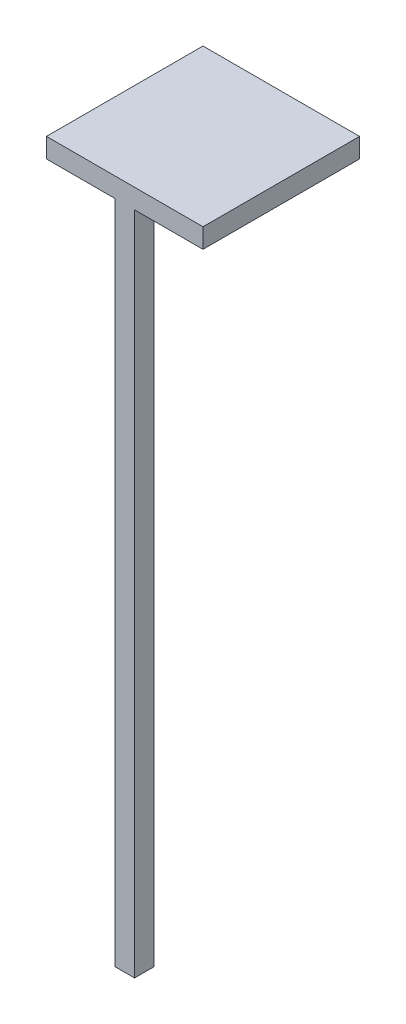
ISO-10303-21;
HEADER;
FILE_DESCRIPTION(('STEP AP214'),'2;1');
FILE_NAME('part.step','',(''),(''),'','','');
FILE_SCHEMA(('AUTOMOTIVE_DESIGN { 1 0 10303 214 1 1 1 1 }'));
ENDSEC;
DATA;
#1=APPLICATION_CONTEXT('core data for automotive mechanical design processes');
#2=APPLICATION_PROTOCOL_DEFINITION('international standard','automotive_design',2000,#1);
#3=PRODUCT_CONTEXT('',#1,'mechanical');
#4=PRODUCT('Part','Part','',(#3));
#5=PRODUCT_RELATED_PRODUCT_CATEGORY('part','',(#4));
#6=PRODUCT_DEFINITION_FORMATION('','',#4);
#7=PRODUCT_DEFINITION_CONTEXT('part definition',#1,'design');
#8=PRODUCT_DEFINITION('design','',#6,#7);
#9=PRODUCT_DEFINITION_SHAPE('','',#8);
#10=(LENGTH_UNIT() NAMED_UNIT(*) SI_UNIT(.MILLI.,.METRE.));
#11=(NAMED_UNIT(*) PLANE_ANGLE_UNIT() SI_UNIT($,.RADIAN.));
#12=(NAMED_UNIT(*) SI_UNIT($,.STERADIAN.) SOLID_ANGLE_UNIT());
#13=UNCERTAINTY_MEASURE_WITH_UNIT(LENGTH_MEASURE(1.E-05),#10,'distance_accuracy_value','');
#14=(GEOMETRIC_REPRESENTATION_CONTEXT(3) GLOBAL_UNCERTAINTY_ASSIGNED_CONTEXT((#13)) GLOBAL_UNIT_ASSIGNED_CONTEXT((#10,
#11,#12)) REPRESENTATION_CONTEXT('',''));
#15=CARTESIAN_POINT('',(0.,0.,0.));
#16=DIRECTION('',(0.,0.,1.));
#17=DIRECTION('',(1.,0.,0.));
#18=AXIS2_PLACEMENT_3D('',#15,#16,#17);
#19=CARTESIAN_POINT('',(0.,340.,0.));
#20=DIRECTION('',(1.,0.,0.));
#21=DIRECTION('',(0.,0.,-1.));
#22=AXIS2_PLACEMENT_3D('',#19,#20,#21);
#23=PLANE('',#22);
#24=DIRECTION('',(0.,0.,1.));
#25=VECTOR('',#24,1.);
#26=CARTESIAN_POINT('',(0.,0.,0.));
#27=LINE('',#26,#25);
#28=CARTESIAN_POINT('',(0.,0.,-10.));
#29=VERTEX_POINT('',#28);
#30=CARTESIAN_POINT('',(0.,0.,0.));
#31=VERTEX_POINT('',#30);
#32=EDGE_CURVE('E129',#29,#31,#27,.T.);
#33=ORIENTED_EDGE('',*,*,#32,.T.);
#34=DIRECTION('',(0.,-1.,0.));
#35=VECTOR('',#34,1.);
#36=CARTESIAN_POINT('',(0.,340.,0.));
#37=LINE('',#36,#35);
#38=CARTESIAN_POINT('',(0.,340.,0.));
#39=VERTEX_POINT('',#38);
#40=EDGE_CURVE('E11',#39,#31,#37,.T.);
#41=ORIENTED_EDGE('',*,*,#40,.F.);
#42=DIRECTION('',(0.,0.,1.));
#43=VECTOR('',#42,1.);
#44=CARTESIAN_POINT('',(0.,340.,0.));
#45=LINE('',#44,#43);
#46=CARTESIAN_POINT('',(0.,340.,-10.));
#47=VERTEX_POINT('',#46);
#48=EDGE_CURVE('E187',#47,#39,#45,.T.);
#49=ORIENTED_EDGE('',*,*,#48,.F.);
#50=DIRECTION('',(0.,-1.,0.));
#51=VECTOR('',#50,1.);
#52=CARTESIAN_POINT('',(0.,340.,-10.));
#53=LINE('',#52,#51);
#54=EDGE_CURVE('E180',#47,#29,#53,.T.);
#55=ORIENTED_EDGE('',*,*,#54,.T.);
#56=EDGE_LOOP('',(#33,#41,#49,#55));
#57=FACE_BOUND('',#56,.T.);
#58=ADVANCED_FACE('F30',(#57),#23,.F.);
#59=CARTESIAN_POINT('',(0.,340.,0.));
#60=DIRECTION('',(0.,0.,-1.));
#61=DIRECTION('',(-1.,0.,0.));
#62=AXIS2_PLACEMENT_3D('',#59,#60,#61);
#63=PLANE('',#62);
#64=DIRECTION('',(1.,0.,0.));
#65=VECTOR('',#64,1.);
#66=CARTESIAN_POINT('',(0.,0.,0.));
#67=LINE('',#66,#65);
#68=CARTESIAN_POINT('',(10.,0.,0.));
#69=VERTEX_POINT('',#68);
#70=EDGE_CURVE('E131',#31,#69,#67,.T.);
#71=ORIENTED_EDGE('',*,*,#70,.T.);
#72=DIRECTION('',(0.,-1.,0.));
#73=VECTOR('',#72,1.);
#74=CARTESIAN_POINT('',(10.,340.,0.));
#75=LINE('',#74,#73);
#76=CARTESIAN_POINT('',(10.,340.,0.));
#77=VERTEX_POINT('',#76);
#78=EDGE_CURVE('E39',#77,#69,#75,.T.);
#79=ORIENTED_EDGE('',*,*,#78,.F.);
#80=DIRECTION('',(1.,0.,0.));
#81=VECTOR('',#80,1.);
#82=CARTESIAN_POINT('',(-35.,340.,0.));
#83=LINE('',#82,#81);
#84=CARTESIAN_POINT('',(45.,340.,0.));
#85=VERTEX_POINT('',#84);
#86=EDGE_CURVE('E141',#77,#85,#83,.T.);
#87=ORIENTED_EDGE('',*,*,#86,.T.);
#88=DIRECTION('',(0.,-1.,0.));
#89=VECTOR('',#88,1.);
#90=CARTESIAN_POINT('',(45.,350.,0.));
#91=LINE('',#90,#89);
#92=CARTESIAN_POINT('',(45.,350.,0.));
#93=VERTEX_POINT('',#92);
#94=EDGE_CURVE('E111',#93,#85,#91,.T.);
#95=ORIENTED_EDGE('',*,*,#94,.F.);
#96=DIRECTION('',(1.,0.,0.));
#97=VECTOR('',#96,1.);
#98=CARTESIAN_POINT('',(-35.,350.,0.));
#99=LINE('',#98,#97);
#100=CARTESIAN_POINT('',(-35.,350.,0.));
#101=VERTEX_POINT('',#100);
#102=EDGE_CURVE('E103',#101,#93,#99,.T.);
#103=ORIENTED_EDGE('',*,*,#102,.F.);
#104=DIRECTION('',(0.,-1.,0.));
#105=VECTOR('',#104,1.);
#106=CARTESIAN_POINT('',(-35.,350.,0.));
#107=LINE('',#106,#105);
#108=CARTESIAN_POINT('',(-35.,340.,0.));
#109=VERTEX_POINT('',#108);
#110=EDGE_CURVE('E108',#101,#109,#107,.T.);
#111=ORIENTED_EDGE('',*,*,#110,.T.);
#112=EDGE_CURVE('E137',#109,#39,#83,.T.);
#113=ORIENTED_EDGE('',*,*,#112,.T.);
#114=ORIENTED_EDGE('',*,*,#40,.T.);
#115=EDGE_LOOP('',(#71,#79,#87,#95,#103,#111,#113,#114));
#116=FACE_BOUND('',#115,.T.);
#117=ADVANCED_FACE('F105',(#116),#63,.F.);
#118=CARTESIAN_POINT('',(10.,340.,0.));
#119=DIRECTION('',(-1.,0.,0.));
#120=DIRECTION('',(0.,0.,1.));
#121=AXIS2_PLACEMENT_3D('',#118,#119,#120);
#122=PLANE('',#121);
#123=DIRECTION('',(0.,0.,-1.));
#124=VECTOR('',#123,1.);
#125=CARTESIAN_POINT('',(10.,0.,0.));
#126=LINE('',#125,#124);
#127=CARTESIAN_POINT('',(10.,0.,-10.));
#128=VERTEX_POINT('',#127);
#129=EDGE_CURVE('E63',#69,#128,#126,.T.);
#130=ORIENTED_EDGE('',*,*,#129,.T.);
#131=DIRECTION('',(0.,-1.,0.));
#132=VECTOR('',#131,1.);
#133=CARTESIAN_POINT('',(10.,340.,-10.));
#134=LINE('',#133,#132);
#135=CARTESIAN_POINT('',(10.,340.,-10.));
#136=VERTEX_POINT('',#135);
#137=EDGE_CURVE('E47',#136,#128,#134,.T.);
#138=ORIENTED_EDGE('',*,*,#137,.F.);
#139=DIRECTION('',(0.,0.,-1.));
#140=VECTOR('',#139,1.);
#141=CARTESIAN_POINT('',(10.,340.,0.));
#142=LINE('',#141,#140);
#143=EDGE_CURVE('E194',#77,#136,#142,.T.);
#144=ORIENTED_EDGE('',*,*,#143,.F.);
#145=ORIENTED_EDGE('',*,*,#78,.T.);
#146=EDGE_LOOP('',(#130,#138,#144,#145));
#147=FACE_BOUND('',#146,.T.);
#148=ADVANCED_FACE('F178',(#147),#122,.F.);
#149=CARTESIAN_POINT('',(0.,340.,-10.));
#150=DIRECTION('',(0.,0.,1.));
#151=DIRECTION('',(1.,0.,0.));
#152=AXIS2_PLACEMENT_3D('',#149,#150,#151);
#153=PLANE('',#152);
#154=DIRECTION('',(-1.,0.,0.));
#155=VECTOR('',#154,1.);
#156=CARTESIAN_POINT('',(0.,0.,-10.));
#157=LINE('',#156,#155);
#158=EDGE_CURVE('E68',#128,#29,#157,.T.);
#159=ORIENTED_EDGE('',*,*,#158,.T.);
#160=ORIENTED_EDGE('',*,*,#54,.F.);
#161=DIRECTION('',(-1.,0.,0.));
#162=VECTOR('',#161,1.);
#163=CARTESIAN_POINT('',(0.,340.,-10.));
#164=LINE('',#163,#162);
#165=EDGE_CURVE('E189',#136,#47,#164,.T.);
#166=ORIENTED_EDGE('',*,*,#165,.F.);
#167=ORIENTED_EDGE('',*,*,#137,.T.);
#168=EDGE_LOOP('',(#159,#160,#166,#167));
#169=FACE_BOUND('',#168,.T.);
#170=ADVANCED_FACE('F199',(#169),#153,.F.);
#171=CARTESIAN_POINT('',(0.,0.,-10.));
#172=DIRECTION('',(0.,-1.,0.));
#173=DIRECTION('',(0.,0.,-1.));
#174=AXIS2_PLACEMENT_3D('',#171,#172,#173);
#175=PLANE('',#174);
#176=ORIENTED_EDGE('',*,*,#32,.F.);
#177=ORIENTED_EDGE('',*,*,#158,.F.);
#178=ORIENTED_EDGE('',*,*,#129,.F.);
#179=ORIENTED_EDGE('',*,*,#70,.F.);
#180=EDGE_LOOP('',(#176,#177,#178,#179));
#181=FACE_BOUND('',#180,.T.);
#182=ADVANCED_FACE('F172',(#181),#175,.T.);
#183=CARTESIAN_POINT('',(-35.,350.,0.));
#184=DIRECTION('',(1.,0.,0.));
#185=DIRECTION('',(0.,0.,-1.));
#186=AXIS2_PLACEMENT_3D('',#183,#184,#185);
#187=PLANE('',#186);
#188=DIRECTION('',(0.,0.,1.));
#189=VECTOR('',#188,1.);
#190=CARTESIAN_POINT('',(-35.,340.,0.));
#191=LINE('',#190,#189);
#192=CARTESIAN_POINT('',(-35.,340.,-80.));
#193=VERTEX_POINT('',#192);
#194=EDGE_CURVE('E128',#193,#109,#191,.T.);
#195=ORIENTED_EDGE('',*,*,#194,.T.);
#196=ORIENTED_EDGE('',*,*,#110,.F.);
#197=DIRECTION('',(0.,0.,1.));
#198=VECTOR('',#197,1.);
#199=CARTESIAN_POINT('',(-35.,350.,0.));
#200=LINE('',#199,#198);
#201=CARTESIAN_POINT('',(-35.,350.,-80.));
#202=VERTEX_POINT('',#201);
#203=EDGE_CURVE('E115',#202,#101,#200,.T.);
#204=ORIENTED_EDGE('',*,*,#203,.F.);
#205=DIRECTION('',(0.,-1.,0.));
#206=VECTOR('',#205,1.);
#207=CARTESIAN_POINT('',(-35.,350.,-80.));
#208=LINE('',#207,#206);
#209=EDGE_CURVE('E150',#202,#193,#208,.T.);
#210=ORIENTED_EDGE('',*,*,#209,.T.);
#211=EDGE_LOOP('',(#195,#196,#204,#210));
#212=FACE_BOUND('',#211,.T.);
#213=ADVANCED_FACE('F126',(#212),#187,.F.);
#214=CARTESIAN_POINT('',(45.,350.,0.));
#215=DIRECTION('',(-1.,0.,0.));
#216=DIRECTION('',(0.,0.,1.));
#217=AXIS2_PLACEMENT_3D('',#214,#215,#216);
#218=PLANE('',#217);
#219=DIRECTION('',(0.,0.,-1.));
#220=VECTOR('',#219,1.);
#221=CARTESIAN_POINT('',(45.,340.,0.));
#222=LINE('',#221,#220);
#223=CARTESIAN_POINT('',(45.,340.,-80.));
#224=VERTEX_POINT('',#223);
#225=EDGE_CURVE('E140',#85,#224,#222,.T.);
#226=ORIENTED_EDGE('',*,*,#225,.T.);
#227=DIRECTION('',(0.,-1.,0.));
#228=VECTOR('',#227,1.);
#229=CARTESIAN_POINT('',(45.,350.,-80.));
#230=LINE('',#229,#228);
#231=CARTESIAN_POINT('',(45.,350.,-80.));
#232=VERTEX_POINT('',#231);
#233=EDGE_CURVE('E133',#232,#224,#230,.T.);
#234=ORIENTED_EDGE('',*,*,#233,.F.);
#235=DIRECTION('',(0.,0.,-1.));
#236=VECTOR('',#235,1.);
#237=CARTESIAN_POINT('',(45.,350.,0.));
#238=LINE('',#237,#236);
#239=EDGE_CURVE('E114',#93,#232,#238,.T.);
#240=ORIENTED_EDGE('',*,*,#239,.F.);
#241=ORIENTED_EDGE('',*,*,#94,.T.);
#242=EDGE_LOOP('',(#226,#234,#240,#241));
#243=FACE_BOUND('',#242,.T.);
#244=ADVANCED_FACE('F163',(#243),#218,.F.);
#245=CARTESIAN_POINT('',(-35.,350.,-80.));
#246=DIRECTION('',(0.,0.,1.));
#247=DIRECTION('',(1.,0.,0.));
#248=AXIS2_PLACEMENT_3D('',#245,#246,#247);
#249=PLANE('',#248);
#250=DIRECTION('',(-1.,0.,0.));
#251=VECTOR('',#250,1.);
#252=CARTESIAN_POINT('',(-35.,340.,-80.));
#253=LINE('',#252,#251);
#254=EDGE_CURVE('E124',#224,#193,#253,.T.);
#255=ORIENTED_EDGE('',*,*,#254,.T.);
#256=ORIENTED_EDGE('',*,*,#209,.F.);
#257=DIRECTION('',(-1.,0.,0.));
#258=VECTOR('',#257,1.);
#259=CARTESIAN_POINT('',(-35.,350.,-80.));
#260=LINE('',#259,#258);
#261=EDGE_CURVE('E120',#232,#202,#260,.T.);
#262=ORIENTED_EDGE('',*,*,#261,.F.);
#263=ORIENTED_EDGE('',*,*,#233,.T.);
#264=EDGE_LOOP('',(#255,#256,#262,#263));
#265=FACE_BOUND('',#264,.T.);
#266=ADVANCED_FACE('F155',(#265),#249,.F.);
#267=CARTESIAN_POINT('',(-35.,350.,-80.));
#268=DIRECTION('',(0.,-1.,0.));
#269=DIRECTION('',(0.,0.,-1.));
#270=AXIS2_PLACEMENT_3D('',#267,#268,#269);
#271=PLANE('',#270);
#272=ORIENTED_EDGE('',*,*,#203,.T.);
#273=ORIENTED_EDGE('',*,*,#102,.T.);
#274=ORIENTED_EDGE('',*,*,#239,.T.);
#275=ORIENTED_EDGE('',*,*,#261,.T.);
#276=EDGE_LOOP('',(#272,#273,#274,#275));
#277=FACE_BOUND('',#276,.T.);
#278=ADVANCED_FACE('F118',(#277),#271,.F.);
#279=CARTESIAN_POINT('',(-35.,340.,-80.));
#280=DIRECTION('',(0.,-1.,0.));
#281=DIRECTION('',(0.,0.,-1.));
#282=AXIS2_PLACEMENT_3D('',#279,#280,#281);
#283=PLANE('',#282);
#284=ORIENTED_EDGE('',*,*,#165,.T.);
#285=ORIENTED_EDGE('',*,*,#48,.T.);
#286=ORIENTED_EDGE('',*,*,#112,.F.);
#287=ORIENTED_EDGE('',*,*,#194,.F.);
#288=ORIENTED_EDGE('',*,*,#254,.F.);
#289=ORIENTED_EDGE('',*,*,#225,.F.);
#290=ORIENTED_EDGE('',*,*,#86,.F.);
#291=ORIENTED_EDGE('',*,*,#143,.T.);
#292=EDGE_LOOP('',(#284,#285,#286,#287,#288,#289,#290,#291));
#293=FACE_BOUND('',#292,.T.);
#294=ADVANCED_FACE('F160',(#293),#283,.T.);
#295=CLOSED_SHELL('',(#58,#117,#148,#170,#182,#213,#244,#266,#278,#294));
#296=MANIFOLD_SOLID_BREP('B2',#295);
#297=ADVANCED_BREP_SHAPE_REPRESENTATION('',(#18,#296),#14);
#298=SHAPE_DEFINITION_REPRESENTATION(#9,#297);
ENDSEC;
END-ISO-10303-21;
